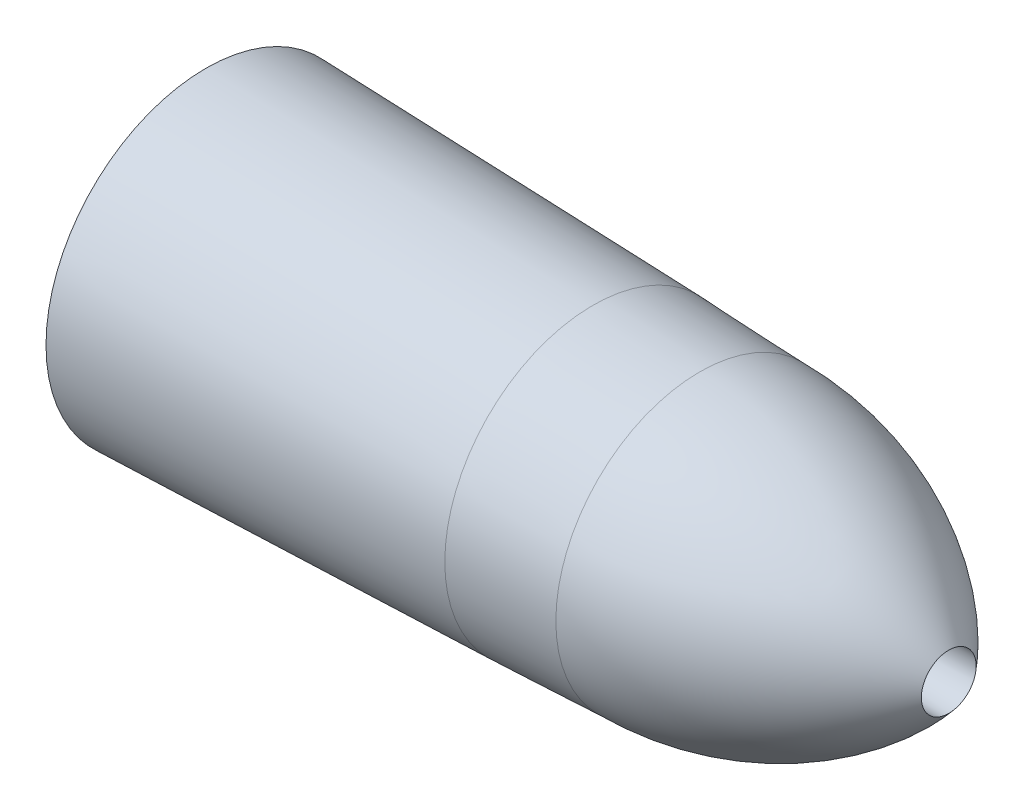
ISO-10303-21;
HEADER;
FILE_DESCRIPTION(('STEP AP214'),'2;1');
FILE_NAME('part.step','',(''),(''),'','','');
FILE_SCHEMA(('AUTOMOTIVE_DESIGN { 1 0 10303 214 1 1 1 1 }'));
ENDSEC;
DATA;
#1=APPLICATION_CONTEXT('core data for automotive mechanical design processes');
#2=APPLICATION_PROTOCOL_DEFINITION('international standard','automotive_design',2000,#1);
#3=PRODUCT_CONTEXT('',#1,'mechanical');
#4=PRODUCT('Part','Part','',(#3));
#5=PRODUCT_RELATED_PRODUCT_CATEGORY('part','',(#4));
#6=PRODUCT_DEFINITION_FORMATION('','',#4);
#7=PRODUCT_DEFINITION_CONTEXT('part definition',#1,'design');
#8=PRODUCT_DEFINITION('design','',#6,#7);
#9=PRODUCT_DEFINITION_SHAPE('','',#8);
#10=(LENGTH_UNIT() NAMED_UNIT(*) SI_UNIT(.MILLI.,.METRE.));
#11=(NAMED_UNIT(*) PLANE_ANGLE_UNIT() SI_UNIT($,.RADIAN.));
#12=(NAMED_UNIT(*) SI_UNIT($,.STERADIAN.) SOLID_ANGLE_UNIT());
#13=UNCERTAINTY_MEASURE_WITH_UNIT(LENGTH_MEASURE(1.E-05),#10,'distance_accuracy_value','');
#14=(GEOMETRIC_REPRESENTATION_CONTEXT(3) GLOBAL_UNCERTAINTY_ASSIGNED_CONTEXT((#13)) GLOBAL_UNIT_ASSIGNED_CONTEXT((#10,
#11,#12)) REPRESENTATION_CONTEXT('',''));
#15=CARTESIAN_POINT('',(0.,0.,0.));
#16=DIRECTION('',(0.,0.,1.));
#17=DIRECTION('',(1.,0.,0.));
#18=AXIS2_PLACEMENT_3D('',#15,#16,#17);
#19=CARTESIAN_POINT('',(-355.,0.,0.));
#20=DIRECTION('',(-1.,0.,0.));
#21=DIRECTION('',(0.,0.,1.));
#22=AXIS2_PLACEMENT_3D('',#19,#20,#21);
#23=PLANE('',#22);
#24=CARTESIAN_POINT('',(-355.,0.,0.));
#25=DIRECTION('',(-1.,0.,0.));
#26=DIRECTION('',(0.,0.,1.));
#27=AXIS2_PLACEMENT_3D('',#24,#25,#26);
#28=CIRCLE('',#27,76.3943727);
#29=CARTESIAN_POINT('',(-355.,0.,76.3943727));
#30=VERTEX_POINT('',#29);
#31=EDGE_CURVE('E60',#30,#30,#28,.T.);
#32=ORIENTED_EDGE('',*,*,#31,.T.);
#33=EDGE_LOOP('',(#32));
#34=FACE_BOUND('',#33,.T.);
#35=CARTESIAN_POINT('',(-355.,0.,0.));
#36=DIRECTION('',(-1.,0.,0.));
#37=DIRECTION('',(0.,0.,1.));
#38=AXIS2_PLACEMENT_3D('',#35,#36,#37);
#39=CIRCLE('',#38,12.3);
#40=CARTESIAN_POINT('',(-355.,0.,12.3));
#41=VERTEX_POINT('',#40);
#42=EDGE_CURVE('E10',#41,#41,#39,.T.);
#43=ORIENTED_EDGE('',*,*,#42,.F.);
#44=EDGE_LOOP('',(#43));
#45=FACE_BOUND('',#44,.T.);
#46=ADVANCED_FACE('F41',(#34,#45),#23,.T.);
#47=CARTESIAN_POINT('',(-355.,0.,0.));
#48=DIRECTION('',(1.,0.,0.));
#49=DIRECTION('',(0.,0.,-1.));
#50=AXIS2_PLACEMENT_3D('',#47,#48,#49);
#51=CONICAL_SURFACE('',#50,12.3,0.00225351731204357);
#52=CARTESIAN_POINT('',(0.,0.,0.));
#53=DIRECTION('',(-1.,0.,0.));
#54=DIRECTION('',(0.,0.,1.));
#55=AXIS2_PLACEMENT_3D('',#52,#53,#54);
#56=CIRCLE('',#55,13.1);
#57=CARTESIAN_POINT('',(0.,0.,13.1));
#58=VERTEX_POINT('',#57);
#59=EDGE_CURVE('E47',#58,#58,#56,.T.);
#60=ORIENTED_EDGE('',*,*,#59,.F.);
#61=EDGE_LOOP('',(#60));
#62=FACE_BOUND('',#61,.T.);
#63=ORIENTED_EDGE('',*,*,#42,.T.);
#64=EDGE_LOOP('',(#63));
#65=FACE_BOUND('',#64,.T.);
#66=ADVANCED_FACE('F78',(#62,#65),#51,.F.);
#67=CARTESIAN_POINT('',(-119.,0.,0.));
#68=DIRECTION('',(-1.,0.,0.));
#69=DIRECTION('',(0.,0.,1.));
#70=AXIS2_PLACEMENT_3D('',#67,#68,#69);
#71=DEGENERATE_TOROIDAL_SURFACE('',#70,86.2939538884257,155.048889288426,.F.);
#72=ORIENTED_EDGE('',*,*,#59,.T.);
#73=EDGE_LOOP('',(#72));
#74=FACE_BOUND('',#73,.T.);
#75=CARTESIAN_POINT('',(-119.,0.,0.));
#76=DIRECTION('',(-1.,0.,0.));
#77=DIRECTION('',(0.,0.,1.));
#78=AXIS2_PLACEMENT_3D('',#75,#76,#77);
#79=CIRCLE('',#78,68.7549354);
#80=CARTESIAN_POINT('',(-119.,0.,68.7549354));
#81=VERTEX_POINT('',#80);
#82=EDGE_CURVE('E51',#81,#81,#79,.T.);
#83=ORIENTED_EDGE('',*,*,#82,.F.);
#84=EDGE_LOOP('',(#83));
#85=FACE_BOUND('',#84,.T.);
#86=ADVANCED_FACE('F74',(#74,#85),#71,.F.);
#87=CARTESIAN_POINT('',(-119.,0.,0.));
#88=DIRECTION('',(-1.,0.,0.));
#89=DIRECTION('',(0.,0.,1.));
#90=AXIS2_PLACEMENT_3D('',#87,#88,#89);
#91=CONICAL_SURFACE('',#90,68.7549354,0.0405466732022535);
#92=CARTESIAN_POINT('',(-170.,0.,0.));
#93=DIRECTION('',(-1.,0.,0.));
#94=DIRECTION('',(0.,0.,1.));
#95=AXIS2_PLACEMENT_3D('',#92,#93,#94);
#96=CIRCLE('',#95,70.8239497);
#97=CARTESIAN_POINT('',(-170.,0.,70.8239497));
#98=VERTEX_POINT('',#97);
#99=EDGE_CURVE('E55',#98,#98,#96,.T.);
#100=ORIENTED_EDGE('',*,*,#99,.F.);
#101=EDGE_LOOP('',(#100));
#102=FACE_BOUND('',#101,.T.);
#103=ORIENTED_EDGE('',*,*,#82,.T.);
#104=EDGE_LOOP('',(#103));
#105=FACE_BOUND('',#104,.T.);
#106=ADVANCED_FACE('F68',(#102,#105),#91,.T.);
#107=CARTESIAN_POINT('',(-355.,0.,0.));
#108=DIRECTION('',(-1.,0.,0.));
#109=DIRECTION('',(0.,0.,1.));
#110=AXIS2_PLACEMENT_3D('',#107,#108,#109);
#111=CONICAL_SURFACE('',#110,76.3943727,0.0301012998202788);
#112=ORIENTED_EDGE('',*,*,#99,.T.);
#113=EDGE_LOOP('',(#112));
#114=FACE_BOUND('',#113,.T.);
#115=ORIENTED_EDGE('',*,*,#31,.F.);
#116=EDGE_LOOP('',(#115));
#117=FACE_BOUND('',#116,.T.);
#118=ADVANCED_FACE('F66',(#114,#117),#111,.T.);
#119=CLOSED_SHELL('',(#46,#66,#86,#106,#118));
#120=MANIFOLD_SOLID_BREP('B2',#119);
#121=ADVANCED_BREP_SHAPE_REPRESENTATION('',(#18,#120),#14);
#122=SHAPE_DEFINITION_REPRESENTATION(#9,#121);
ENDSEC;
END-ISO-10303-21;
